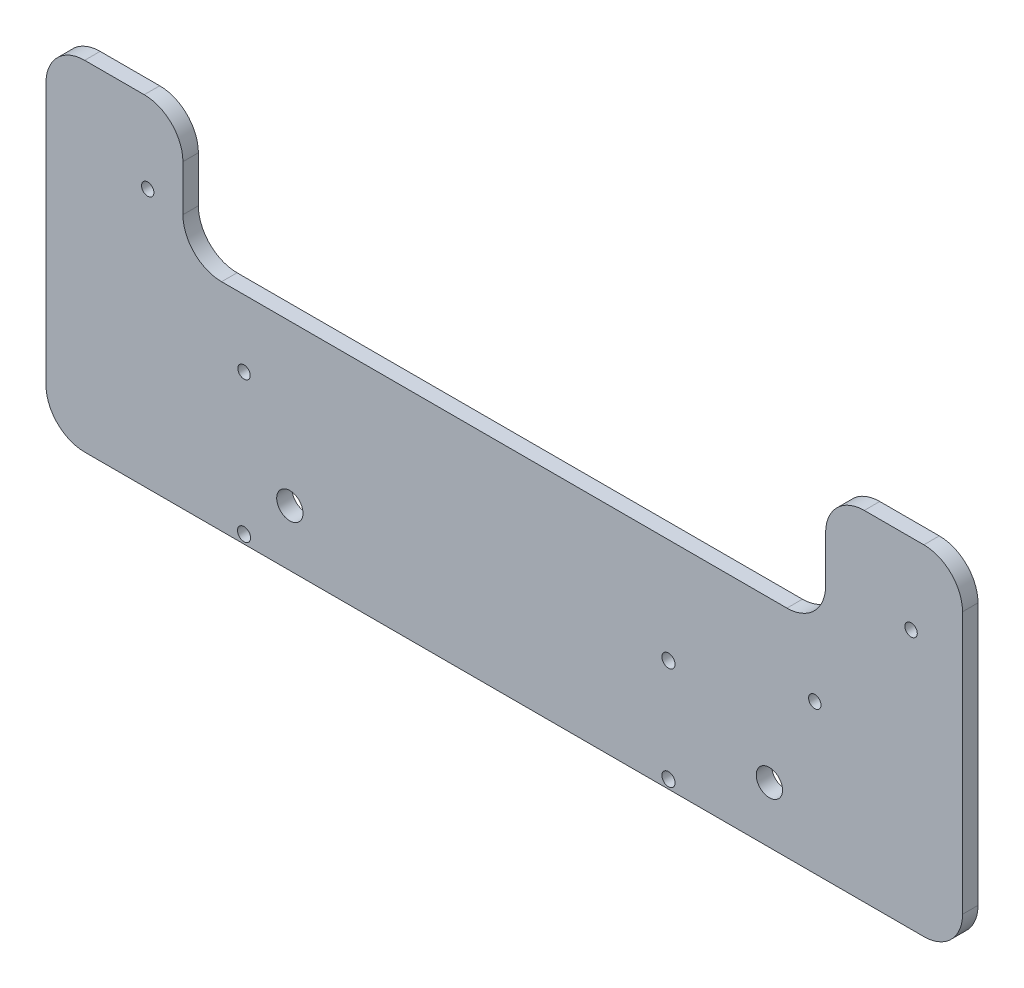
ISO-10303-21;
HEADER;
FILE_DESCRIPTION(('STEP AP214'),'2;1');
FILE_NAME('part.step','',(''),(''),'','','');
FILE_SCHEMA(('AUTOMOTIVE_DESIGN { 1 0 10303 214 1 1 1 1 }'));
ENDSEC;
DATA;
#1=APPLICATION_CONTEXT('core data for automotive mechanical design processes');
#2=APPLICATION_PROTOCOL_DEFINITION('international standard','automotive_design',2000,#1);
#3=PRODUCT_CONTEXT('',#1,'mechanical');
#4=PRODUCT('Part','Part','',(#3));
#5=PRODUCT_RELATED_PRODUCT_CATEGORY('part','',(#4));
#6=PRODUCT_DEFINITION_FORMATION('','',#4);
#7=PRODUCT_DEFINITION_CONTEXT('part definition',#1,'design');
#8=PRODUCT_DEFINITION('design','',#6,#7);
#9=PRODUCT_DEFINITION_SHAPE('','',#8);
#10=(LENGTH_UNIT() NAMED_UNIT(*) SI_UNIT(.MILLI.,.METRE.));
#11=(NAMED_UNIT(*) PLANE_ANGLE_UNIT() SI_UNIT($,.RADIAN.));
#12=(NAMED_UNIT(*) SI_UNIT($,.STERADIAN.) SOLID_ANGLE_UNIT());
#13=UNCERTAINTY_MEASURE_WITH_UNIT(LENGTH_MEASURE(1.E-05),#10,'distance_accuracy_value','');
#14=(GEOMETRIC_REPRESENTATION_CONTEXT(3) GLOBAL_UNCERTAINTY_ASSIGNED_CONTEXT((#13)) GLOBAL_UNIT_ASSIGNED_CONTEXT((#10,
#11,#12)) REPRESENTATION_CONTEXT('',''));
#15=CARTESIAN_POINT('',(0.,0.,0.));
#16=DIRECTION('',(0.,0.,1.));
#17=DIRECTION('',(1.,0.,0.));
#18=AXIS2_PLACEMENT_3D('',#15,#16,#17);
#19=CARTESIAN_POINT('',(128.627293892868,-271.718782294227,4.));
#20=DIRECTION('',(0.,-1.,0.));
#21=DIRECTION('',(0.,0.,-1.));
#22=AXIS2_PLACEMENT_3D('',#19,#20,#21);
#23=PLANE('',#22);
#24=DIRECTION('',(-1.,0.,0.));
#25=VECTOR('',#24,1.);
#26=CARTESIAN_POINT('',(128.627293892868,-271.718782294227,4.));
#27=LINE('',#26,#25);
#28=CARTESIAN_POINT('',(118.627293892868,-271.718782294227,4.));
#29=VERTEX_POINT('',#28);
#30=CARTESIAN_POINT('',(103.222758288593,-271.718782294227,4.));
#31=VERTEX_POINT('',#30);
#32=EDGE_CURVE('E384',#29,#31,#27,.T.);
#33=ORIENTED_EDGE('',*,*,#32,.F.);
#34=DIRECTION('',(0.,0.,-1.));
#35=VECTOR('',#34,1.);
#36=CARTESIAN_POINT('',(118.627293892868,-271.718782294227,4.));
#37=LINE('',#36,#35);
#38=CARTESIAN_POINT('',(118.627293892868,-271.718782294227,0.));
#39=VERTEX_POINT('',#38);
#40=EDGE_CURVE('E214',#29,#39,#37,.T.);
#41=ORIENTED_EDGE('',*,*,#40,.T.);
#42=DIRECTION('',(-1.,0.,0.));
#43=VECTOR('',#42,1.);
#44=CARTESIAN_POINT('',(128.627293892868,-271.718782294227,0.));
#45=LINE('',#44,#43);
#46=CARTESIAN_POINT('',(103.222758288593,-271.718782294227,0.));
#47=VERTEX_POINT('',#46);
#48=EDGE_CURVE('E275',#39,#47,#45,.T.);
#49=ORIENTED_EDGE('',*,*,#48,.T.);
#50=DIRECTION('',(0.,0.,-1.));
#51=VECTOR('',#50,1.);
#52=CARTESIAN_POINT('',(103.222758288593,-271.718782294227,4.));
#53=LINE('',#52,#51);
#54=EDGE_CURVE('E212',#47,#31,#53,.F.);
#55=ORIENTED_EDGE('',*,*,#54,.T.);
#56=EDGE_LOOP('',(#33,#41,#49,#55));
#57=FACE_BOUND('',#56,.T.);
#58=ADVANCED_FACE('F34',(#57),#23,.F.);
#59=CARTESIAN_POINT('',(93.2227582885929,-271.718782294227,4.));
#60=DIRECTION('',(1.,0.,0.));
#61=DIRECTION('',(0.,1.,0.));
#62=AXIS2_PLACEMENT_3D('',#59,#60,#61);
#63=PLANE('',#62);
#64=DIRECTION('',(0.,-1.,0.));
#65=VECTOR('',#64,1.);
#66=CARTESIAN_POINT('',(93.2227582885929,-271.718782294227,4.));
#67=LINE('',#66,#65);
#68=CARTESIAN_POINT('',(93.2227582885929,-281.718782294227,4.));
#69=VERTEX_POINT('',#68);
#70=CARTESIAN_POINT('',(93.222758288593,-293.597286203599,4.));
#71=VERTEX_POINT('',#70);
#72=EDGE_CURVE('E269',#69,#71,#67,.T.);
#73=ORIENTED_EDGE('',*,*,#72,.F.);
#74=DIRECTION('',(0.,0.,-1.));
#75=VECTOR('',#74,1.);
#76=CARTESIAN_POINT('',(93.2227582885929,-281.718782294227,4.));
#77=LINE('',#76,#75);
#78=CARTESIAN_POINT('',(93.2227582885929,-281.718782294227,0.));
#79=VERTEX_POINT('',#78);
#80=EDGE_CURVE('E219',#69,#79,#77,.T.);
#81=ORIENTED_EDGE('',*,*,#80,.T.);
#82=DIRECTION('',(0.,-1.,0.));
#83=VECTOR('',#82,1.);
#84=CARTESIAN_POINT('',(93.2227582885929,-271.718782294227,0.));
#85=LINE('',#84,#83);
#86=CARTESIAN_POINT('',(93.222758288593,-293.597286203599,0.));
#87=VERTEX_POINT('',#86);
#88=EDGE_CURVE('E253',#79,#87,#85,.T.);
#89=ORIENTED_EDGE('',*,*,#88,.T.);
#90=DIRECTION('',(0.,0.,-1.));
#91=VECTOR('',#90,1.);
#92=CARTESIAN_POINT('',(93.222758288593,-293.597286203599,4.));
#93=LINE('',#92,#91);
#94=EDGE_CURVE('E217',#87,#71,#93,.F.);
#95=ORIENTED_EDGE('',*,*,#94,.T.);
#96=EDGE_LOOP('',(#73,#81,#89,#95));
#97=FACE_BOUND('',#96,.T.);
#98=ADVANCED_FACE('F301',(#97),#63,.F.);
#99=CARTESIAN_POINT('',(93.222758288593,-303.597286203599,4.));
#100=DIRECTION('',(0.,-1.,0.));
#101=DIRECTION('',(0.,0.,-1.));
#102=AXIS2_PLACEMENT_3D('',#99,#100,#101);
#103=PLANE('',#102);
#104=DIRECTION('',(-1.,0.,0.));
#105=VECTOR('',#104,1.);
#106=CARTESIAN_POINT('',(93.222758288593,-303.597286203599,4.));
#107=LINE('',#106,#105);
#108=CARTESIAN_POINT('',(83.222758288593,-303.597286203599,4.));
#109=VERTEX_POINT('',#108);
#110=CARTESIAN_POINT('',(-62.9681705028575,-303.597286203599,4.));
#111=VERTEX_POINT('',#110);
#112=EDGE_CURVE('E261',#109,#111,#107,.T.);
#113=ORIENTED_EDGE('',*,*,#112,.F.);
#114=DIRECTION('',(0.,0.,-1.));
#115=VECTOR('',#114,1.);
#116=CARTESIAN_POINT('',(83.222758288593,-303.597286203599,0.));
#117=LINE('',#116,#115);
#118=CARTESIAN_POINT('',(83.222758288593,-303.597286203599,0.));
#119=VERTEX_POINT('',#118);
#120=EDGE_CURVE('E224',#109,#119,#117,.T.);
#121=ORIENTED_EDGE('',*,*,#120,.T.);
#122=DIRECTION('',(-1.,0.,0.));
#123=VECTOR('',#122,1.);
#124=CARTESIAN_POINT('',(93.222758288593,-303.597286203599,0.));
#125=LINE('',#124,#123);
#126=CARTESIAN_POINT('',(-62.9681705028575,-303.597286203599,0.));
#127=VERTEX_POINT('',#126);
#128=EDGE_CURVE('E242',#119,#127,#125,.T.);
#129=ORIENTED_EDGE('',*,*,#128,.T.);
#130=DIRECTION('',(0.,0.,-1.));
#131=VECTOR('',#130,1.);
#132=CARTESIAN_POINT('',(-62.9681705028574,-303.597286203599,4.));
#133=LINE('',#132,#131);
#134=EDGE_CURVE('E222',#127,#111,#133,.F.);
#135=ORIENTED_EDGE('',*,*,#134,.T.);
#136=EDGE_LOOP('',(#113,#121,#129,#135));
#137=FACE_BOUND('',#136,.T.);
#138=ADVANCED_FACE('F250',(#137),#103,.F.);
#139=CARTESIAN_POINT('',(-72.9681705028574,-271.718782294227,4.));
#140=DIRECTION('',(-1.,0.,0.));
#141=DIRECTION('',(0.,-1.,0.));
#142=AXIS2_PLACEMENT_3D('',#139,#140,#141);
#143=PLANE('',#142);
#144=DIRECTION('',(0.,1.,0.));
#145=VECTOR('',#144,1.);
#146=CARTESIAN_POINT('',(-72.9681705028574,-271.718782294227,4.));
#147=LINE('',#146,#145);
#148=CARTESIAN_POINT('',(-72.9681705028574,-293.597286203599,4.));
#149=VERTEX_POINT('',#148);
#150=CARTESIAN_POINT('',(-72.9681705028574,-281.718782294227,4.));
#151=VERTEX_POINT('',#150);
#152=EDGE_CURVE('E260',#149,#151,#147,.T.);
#153=ORIENTED_EDGE('',*,*,#152,.F.);
#154=DIRECTION('',(0.,0.,-1.));
#155=VECTOR('',#154,1.);
#156=CARTESIAN_POINT('',(-72.9681705028574,-293.597286203599,0.));
#157=LINE('',#156,#155);
#158=CARTESIAN_POINT('',(-72.9681705028574,-293.597286203599,0.));
#159=VERTEX_POINT('',#158);
#160=EDGE_CURVE('E233',#149,#159,#157,.T.);
#161=ORIENTED_EDGE('',*,*,#160,.T.);
#162=DIRECTION('',(0.,1.,0.));
#163=VECTOR('',#162,1.);
#164=CARTESIAN_POINT('',(-72.9681705028574,-271.718782294227,0.));
#165=LINE('',#164,#163);
#166=CARTESIAN_POINT('',(-72.9681705028574,-281.718782294227,0.));
#167=VERTEX_POINT('',#166);
#168=EDGE_CURVE('E244',#159,#167,#165,.T.);
#169=ORIENTED_EDGE('',*,*,#168,.T.);
#170=DIRECTION('',(0.,0.,-1.));
#171=VECTOR('',#170,1.);
#172=CARTESIAN_POINT('',(-72.9681705028574,-281.718782294227,4.));
#173=LINE('',#172,#171);
#174=EDGE_CURVE('E231',#167,#151,#173,.F.);
#175=ORIENTED_EDGE('',*,*,#174,.T.);
#176=EDGE_LOOP('',(#153,#161,#169,#175));
#177=FACE_BOUND('',#176,.T.);
#178=ADVANCED_FACE('F263',(#177),#143,.F.);
#179=CARTESIAN_POINT('',(-108.372706107132,-271.718782294227,4.));
#180=DIRECTION('',(0.,-1.,0.));
#181=DIRECTION('',(0.,0.,-1.));
#182=AXIS2_PLACEMENT_3D('',#179,#180,#181);
#183=PLANE('',#182);
#184=DIRECTION('',(-1.,0.,0.));
#185=VECTOR('',#184,1.);
#186=CARTESIAN_POINT('',(-108.372706107132,-271.718782294227,0.));
#187=LINE('',#186,#185);
#188=CARTESIAN_POINT('',(-82.9681705028574,-271.718782294227,0.));
#189=VERTEX_POINT('',#188);
#190=CARTESIAN_POINT('',(-98.3727061071322,-271.718782294227,0.));
#191=VERTEX_POINT('',#190);
#192=EDGE_CURVE('E180',#189,#191,#187,.T.);
#193=ORIENTED_EDGE('',*,*,#192,.T.);
#194=DIRECTION('',(0.,0.,-1.));
#195=VECTOR('',#194,1.);
#196=CARTESIAN_POINT('',(-98.3727061071322,-271.718782294227,4.));
#197=LINE('',#196,#195);
#198=CARTESIAN_POINT('',(-98.3727061071322,-271.718782294227,4.));
#199=VERTEX_POINT('',#198);
#200=EDGE_CURVE('E49',#191,#199,#197,.F.);
#201=ORIENTED_EDGE('',*,*,#200,.T.);
#202=DIRECTION('',(-1.,0.,0.));
#203=VECTOR('',#202,1.);
#204=CARTESIAN_POINT('',(-108.372706107132,-271.718782294227,4.));
#205=LINE('',#204,#203);
#206=CARTESIAN_POINT('',(-82.9681705028574,-271.718782294227,4.));
#207=VERTEX_POINT('',#206);
#208=EDGE_CURVE('E265',#207,#199,#205,.T.);
#209=ORIENTED_EDGE('',*,*,#208,.F.);
#210=DIRECTION('',(0.,0.,-1.));
#211=VECTOR('',#210,1.);
#212=CARTESIAN_POINT('',(-82.9681705028574,-271.718782294227,4.));
#213=LINE('',#212,#211);
#214=EDGE_CURVE('E227',#207,#189,#213,.T.);
#215=ORIENTED_EDGE('',*,*,#214,.T.);
#216=EDGE_LOOP('',(#193,#201,#209,#215));
#217=FACE_BOUND('',#216,.T.);
#218=ADVANCED_FACE('F282',(#217),#183,.F.);
#219=CARTESIAN_POINT('',(-108.372706107132,-305.665681156461,4.));
#220=DIRECTION('',(1.,0.,0.));
#221=DIRECTION('',(0.,0.,-1.));
#222=AXIS2_PLACEMENT_3D('',#219,#220,#221);
#223=PLANE('',#222);
#224=DIRECTION('',(0.,-1.,0.));
#225=VECTOR('',#224,1.);
#226=CARTESIAN_POINT('',(-108.372706107132,-305.665681156461,0.));
#227=LINE('',#226,#225);
#228=CARTESIAN_POINT('',(-108.372706107132,-281.718782294227,0.));
#229=VERTEX_POINT('',#228);
#230=CARTESIAN_POINT('',(-108.372706107132,-349.464720764101,0.));
#231=VERTEX_POINT('',#230);
#232=EDGE_CURVE('E175',#229,#231,#227,.T.);
#233=ORIENTED_EDGE('',*,*,#232,.T.);
#234=DIRECTION('',(0.,0.,-1.));
#235=VECTOR('',#234,1.);
#236=CARTESIAN_POINT('',(-108.372706107132,-349.464720764101,4.));
#237=LINE('',#236,#235);
#238=CARTESIAN_POINT('',(-108.372706107132,-349.464720764101,4.));
#239=VERTEX_POINT('',#238);
#240=EDGE_CURVE('E153',#231,#239,#237,.F.);
#241=ORIENTED_EDGE('',*,*,#240,.T.);
#242=DIRECTION('',(0.,-1.,0.));
#243=VECTOR('',#242,1.);
#244=CARTESIAN_POINT('',(-108.372706107132,-305.665681156461,4.));
#245=LINE('',#244,#243);
#246=CARTESIAN_POINT('',(-108.372706107132,-281.718782294227,4.));
#247=VERTEX_POINT('',#246);
#248=EDGE_CURVE('E267',#247,#239,#245,.T.);
#249=ORIENTED_EDGE('',*,*,#248,.F.);
#250=DIRECTION('',(0.,0.,-1.));
#251=VECTOR('',#250,1.);
#252=CARTESIAN_POINT('',(-108.372706107132,-281.718782294227,4.));
#253=LINE('',#252,#251);
#254=EDGE_CURVE('E158',#247,#229,#253,.T.);
#255=ORIENTED_EDGE('',*,*,#254,.T.);
#256=EDGE_LOOP('',(#233,#241,#249,#255));
#257=FACE_BOUND('',#256,.T.);
#258=ADVANCED_FACE('F290',(#257),#223,.F.);
#259=CARTESIAN_POINT('',(128.627293892868,-359.464720764101,4.));
#260=DIRECTION('',(0.,1.,0.));
#261=DIRECTION('',(0.,0.,1.));
#262=AXIS2_PLACEMENT_3D('',#259,#260,#261);
#263=PLANE('',#262);
#264=DIRECTION('',(1.,0.,0.));
#265=VECTOR('',#264,1.);
#266=CARTESIAN_POINT('',(128.627293892868,-359.464720764101,4.));
#267=LINE('',#266,#265);
#268=CARTESIAN_POINT('',(-98.3727061071322,-359.464720764101,4.));
#269=VERTEX_POINT('',#268);
#270=CARTESIAN_POINT('',(118.627293892868,-359.464720764101,4.));
#271=VERTEX_POINT('',#270);
#272=EDGE_CURVE('E168',#269,#271,#267,.T.);
#273=ORIENTED_EDGE('',*,*,#272,.F.);
#274=DIRECTION('',(0.,0.,-1.));
#275=VECTOR('',#274,1.);
#276=CARTESIAN_POINT('',(-98.3727061071322,-359.464720764101,4.));
#277=LINE('',#276,#275);
#278=CARTESIAN_POINT('',(-98.3727061071322,-359.464720764101,0.));
#279=VERTEX_POINT('',#278);
#280=EDGE_CURVE('E152',#269,#279,#277,.T.);
#281=ORIENTED_EDGE('',*,*,#280,.T.);
#282=DIRECTION('',(1.,0.,0.));
#283=VECTOR('',#282,1.);
#284=CARTESIAN_POINT('',(128.627293892868,-359.464720764101,0.));
#285=LINE('',#284,#283);
#286=CARTESIAN_POINT('',(118.627293892868,-359.464720764101,0.));
#287=VERTEX_POINT('',#286);
#288=EDGE_CURVE('E165',#279,#287,#285,.T.);
#289=ORIENTED_EDGE('',*,*,#288,.T.);
#290=DIRECTION('',(0.,0.,-1.));
#291=VECTOR('',#290,1.);
#292=CARTESIAN_POINT('',(118.627293892868,-359.464720764101,4.));
#293=LINE('',#292,#291);
#294=EDGE_CURVE('E170',#287,#271,#293,.F.);
#295=ORIENTED_EDGE('',*,*,#294,.T.);
#296=EDGE_LOOP('',(#273,#281,#289,#295));
#297=FACE_BOUND('',#296,.T.);
#298=ADVANCED_FACE('F164',(#297),#263,.F.);
#299=CARTESIAN_POINT('',(128.627293892868,-305.665681156461,4.));
#300=DIRECTION('',(-1.,0.,0.));
#301=DIRECTION('',(0.,0.,1.));
#302=AXIS2_PLACEMENT_3D('',#299,#300,#301);
#303=PLANE('',#302);
#304=DIRECTION('',(0.,1.,0.));
#305=VECTOR('',#304,1.);
#306=CARTESIAN_POINT('',(128.627293892868,-305.665681156461,4.));
#307=LINE('',#306,#305);
#308=CARTESIAN_POINT('',(128.627293892868,-349.464720764101,4.));
#309=VERTEX_POINT('',#308);
#310=CARTESIAN_POINT('',(128.627293892868,-281.718782294227,4.));
#311=VERTEX_POINT('',#310);
#312=EDGE_CURVE('E178',#309,#311,#307,.T.);
#313=ORIENTED_EDGE('',*,*,#312,.F.);
#314=DIRECTION('',(0.,0.,-1.));
#315=VECTOR('',#314,1.);
#316=CARTESIAN_POINT('',(128.627293892868,-349.464720764101,4.));
#317=LINE('',#316,#315);
#318=CARTESIAN_POINT('',(128.627293892868,-349.464720764101,0.));
#319=VERTEX_POINT('',#318);
#320=EDGE_CURVE('E209',#309,#319,#317,.T.);
#321=ORIENTED_EDGE('',*,*,#320,.T.);
#322=DIRECTION('',(0.,1.,0.));
#323=VECTOR('',#322,1.);
#324=CARTESIAN_POINT('',(128.627293892868,-305.665681156461,0.));
#325=LINE('',#324,#323);
#326=CARTESIAN_POINT('',(128.627293892868,-281.718782294227,0.));
#327=VERTEX_POINT('',#326);
#328=EDGE_CURVE('E174',#319,#327,#325,.T.);
#329=ORIENTED_EDGE('',*,*,#328,.T.);
#330=DIRECTION('',(0.,0.,-1.));
#331=VECTOR('',#330,1.);
#332=CARTESIAN_POINT('',(128.627293892868,-281.718782294227,4.));
#333=LINE('',#332,#331);
#334=EDGE_CURVE('E207',#327,#311,#333,.F.);
#335=ORIENTED_EDGE('',*,*,#334,.T.);
#336=EDGE_LOOP('',(#313,#321,#329,#335));
#337=FACE_BOUND('',#336,.T.);
#338=ADVANCED_FACE('F297',(#337),#303,.F.);
#339=CARTESIAN_POINT('',(0.,0.,4.));
#340=DIRECTION('',(0.,0.,1.));
#341=DIRECTION('',(1.,0.,0.));
#342=AXIS2_PLACEMENT_3D('',#339,#340,#341);
#343=PLANE('',#342);
#344=CARTESIAN_POINT('',(52.5925096813906,-330.665681156323,4.));
#345=DIRECTION('',(0.,0.,1.));
#346=DIRECTION('',(1.,0.,0.));
#347=AXIS2_PLACEMENT_3D('',#344,#345,#346);
#348=CIRCLE('',#347,1.69999999999999);
#349=CARTESIAN_POINT('',(54.2925096813906,-330.665681156323,4.));
#350=VERTEX_POINT('',#349);
#351=EDGE_CURVE('E450',#350,#350,#348,.T.);
#352=ORIENTED_EDGE('',*,*,#351,.F.);
#353=EDGE_LOOP('',(#352));
#354=FACE_BOUND('',#353,.T.);
#355=CARTESIAN_POINT('',(52.5925096813906,-357.226830960588,4.));
#356=DIRECTION('',(0.,0.,1.));
#357=DIRECTION('',(1.,0.,0.));
#358=AXIS2_PLACEMENT_3D('',#355,#356,#357);
#359=CIRCLE('',#358,1.69999999999999);
#360=CARTESIAN_POINT('',(54.2925096813906,-357.226830960588,4.));
#361=VERTEX_POINT('',#360);
#362=EDGE_CURVE('E444',#361,#361,#359,.T.);
#363=ORIENTED_EDGE('',*,*,#362,.F.);
#364=EDGE_LOOP('',(#363));
#365=FACE_BOUND('',#364,.T.);
#366=CARTESIAN_POINT('',(-57.1627061071324,-357.226830960588,4.));
#367=DIRECTION('',(0.,0.,1.));
#368=DIRECTION('',(1.,0.,0.));
#369=AXIS2_PLACEMENT_3D('',#366,#367,#368);
#370=CIRCLE('',#369,1.69999999999999);
#371=CARTESIAN_POINT('',(-55.4627061071324,-357.226830960588,4.));
#372=VERTEX_POINT('',#371);
#373=EDGE_CURVE('E438',#372,#372,#370,.T.);
#374=ORIENTED_EDGE('',*,*,#373,.F.);
#375=EDGE_LOOP('',(#374));
#376=FACE_BOUND('',#375,.T.);
#377=CARTESIAN_POINT('',(78.6810147920235,-344.935502047031,4.));
#378=DIRECTION('',(0.,0.,1.));
#379=DIRECTION('',(1.,0.,0.));
#380=AXIS2_PLACEMENT_3D('',#377,#378,#379);
#381=CIRCLE('',#380,3.4);
#382=CARTESIAN_POINT('',(82.0810147920235,-344.935502047031,4.));
#383=VERTEX_POINT('',#382);
#384=EDGE_CURVE('E432',#383,#383,#381,.T.);
#385=ORIENTED_EDGE('',*,*,#384,.F.);
#386=EDGE_LOOP('',(#385));
#387=FACE_BOUND('',#386,.T.);
#388=CARTESIAN_POINT('',(-45.3189852079763,-344.93550204679,4.));
#389=DIRECTION('',(0.,0.,1.));
#390=DIRECTION('',(1.,0.,0.));
#391=AXIS2_PLACEMENT_3D('',#388,#389,#390);
#392=CIRCLE('',#391,3.4);
#393=CARTESIAN_POINT('',(-41.9189852079763,-344.93550204679,4.));
#394=VERTEX_POINT('',#393);
#395=EDGE_CURVE('E426',#394,#394,#392,.T.);
#396=ORIENTED_EDGE('',*,*,#395,.F.);
#397=EDGE_LOOP('',(#396));
#398=FACE_BOUND('',#397,.T.);
#399=CARTESIAN_POINT('',(-82.0727061071323,-292.415681156461,4.));
#400=DIRECTION('',(0.,0.,1.));
#401=DIRECTION('',(1.,0.,0.));
#402=AXIS2_PLACEMENT_3D('',#399,#400,#401);
#403=CIRCLE('',#402,1.6);
#404=CARTESIAN_POINT('',(-80.4727061071324,-292.415681156461,4.));
#405=VERTEX_POINT('',#404);
#406=EDGE_CURVE('E420',#405,#405,#403,.T.);
#407=ORIENTED_EDGE('',*,*,#406,.F.);
#408=EDGE_LOOP('',(#407));
#409=FACE_BOUND('',#408,.T.);
#410=CARTESIAN_POINT('',(115.327293892868,-292.415681156461,4.));
#411=DIRECTION('',(0.,0.,1.));
#412=DIRECTION('',(1.,0.,0.));
#413=AXIS2_PLACEMENT_3D('',#410,#411,#412);
#414=CIRCLE('',#413,1.6);
#415=CARTESIAN_POINT('',(116.927293892868,-292.415681156461,4.));
#416=VERTEX_POINT('',#415);
#417=EDGE_CURVE('E414',#416,#416,#414,.T.);
#418=ORIENTED_EDGE('',*,*,#417,.F.);
#419=EDGE_LOOP('',(#418));
#420=FACE_BOUND('',#419,.T.);
#421=CARTESIAN_POINT('',(90.4172938928678,-320.91568115646,4.));
#422=DIRECTION('',(0.,0.,1.));
#423=DIRECTION('',(1.,0.,0.));
#424=AXIS2_PLACEMENT_3D('',#421,#422,#423);
#425=CIRCLE('',#424,1.6);
#426=CARTESIAN_POINT('',(92.0172938928678,-320.91568115646,4.));
#427=VERTEX_POINT('',#426);
#428=EDGE_CURVE('E408',#427,#427,#425,.T.);
#429=ORIENTED_EDGE('',*,*,#428,.F.);
#430=EDGE_LOOP('',(#429));
#431=FACE_BOUND('',#430,.T.);
#432=CARTESIAN_POINT('',(-57.1627061071323,-320.91568115646,4.));
#433=DIRECTION('',(0.,0.,1.));
#434=DIRECTION('',(1.,0.,0.));
#435=AXIS2_PLACEMENT_3D('',#432,#433,#434);
#436=CIRCLE('',#435,1.6);
#437=CARTESIAN_POINT('',(-55.5627061071323,-320.91568115646,4.));
#438=VERTEX_POINT('',#437);
#439=EDGE_CURVE('E402',#438,#438,#436,.T.);
#440=ORIENTED_EDGE('',*,*,#439,.F.);
#441=EDGE_LOOP('',(#440));
#442=FACE_BOUND('',#441,.T.);
#443=ORIENTED_EDGE('',*,*,#248,.T.);
#444=CARTESIAN_POINT('',(-98.3727061071322,-349.464720764101,4.));
#445=DIRECTION('',(0.,0.,1.));
#446=DIRECTION('',(1.,0.,0.));
#447=AXIS2_PLACEMENT_3D('',#444,#445,#446);
#448=CIRCLE('',#447,10.);
#449=EDGE_CURVE('E205',#239,#269,#448,.T.);
#450=ORIENTED_EDGE('',*,*,#449,.T.);
#451=ORIENTED_EDGE('',*,*,#272,.T.);
#452=CARTESIAN_POINT('',(118.627293892868,-349.464720764101,4.));
#453=DIRECTION('',(0.,0.,1.));
#454=DIRECTION('',(1.,0.,0.));
#455=AXIS2_PLACEMENT_3D('',#452,#453,#454);
#456=CIRCLE('',#455,10.);
#457=EDGE_CURVE('E203',#271,#309,#456,.T.);
#458=ORIENTED_EDGE('',*,*,#457,.T.);
#459=ORIENTED_EDGE('',*,*,#312,.T.);
#460=CARTESIAN_POINT('',(118.627293892868,-281.718782294227,4.));
#461=DIRECTION('',(0.,0.,1.));
#462=DIRECTION('',(1.,0.,0.));
#463=AXIS2_PLACEMENT_3D('',#460,#461,#462);
#464=CIRCLE('',#463,10.);
#465=EDGE_CURVE('E201',#311,#29,#464,.T.);
#466=ORIENTED_EDGE('',*,*,#465,.T.);
#467=ORIENTED_EDGE('',*,*,#32,.T.);
#468=CARTESIAN_POINT('',(103.222758288593,-281.718782294227,4.));
#469=DIRECTION('',(0.,0.,1.));
#470=DIRECTION('',(1.,0.,0.));
#471=AXIS2_PLACEMENT_3D('',#468,#469,#470);
#472=CIRCLE('',#471,10.);
#473=EDGE_CURVE('E199',#31,#69,#472,.T.);
#474=ORIENTED_EDGE('',*,*,#473,.T.);
#475=ORIENTED_EDGE('',*,*,#72,.T.);
#476=CARTESIAN_POINT('',(83.222758288593,-293.597286203599,4.));
#477=DIRECTION('',(0.,0.,1.));
#478=DIRECTION('',(1.,0.,0.));
#479=AXIS2_PLACEMENT_3D('',#476,#477,#478);
#480=CIRCLE('',#479,10.);
#481=EDGE_CURVE('E238',#71,#109,#480,.F.);
#482=ORIENTED_EDGE('',*,*,#481,.T.);
#483=ORIENTED_EDGE('',*,*,#112,.T.);
#484=CARTESIAN_POINT('',(-62.9681705028574,-293.597286203599,4.));
#485=DIRECTION('',(0.,0.,1.));
#486=DIRECTION('',(1.,0.,0.));
#487=AXIS2_PLACEMENT_3D('',#484,#485,#486);
#488=CIRCLE('',#487,10.);
#489=EDGE_CURVE('E11',#111,#149,#488,.F.);
#490=ORIENTED_EDGE('',*,*,#489,.T.);
#491=ORIENTED_EDGE('',*,*,#152,.T.);
#492=CARTESIAN_POINT('',(-82.9681705028574,-281.718782294227,4.));
#493=DIRECTION('',(0.,0.,1.));
#494=DIRECTION('',(1.,0.,0.));
#495=AXIS2_PLACEMENT_3D('',#492,#493,#494);
#496=CIRCLE('',#495,10.);
#497=EDGE_CURVE('E56',#151,#207,#496,.T.);
#498=ORIENTED_EDGE('',*,*,#497,.T.);
#499=ORIENTED_EDGE('',*,*,#208,.T.);
#500=CARTESIAN_POINT('',(-98.3727061071322,-281.718782294227,4.));
#501=DIRECTION('',(0.,0.,1.));
#502=DIRECTION('',(1.,0.,0.));
#503=AXIS2_PLACEMENT_3D('',#500,#501,#502);
#504=CIRCLE('',#503,10.);
#505=EDGE_CURVE('E197',#199,#247,#504,.T.);
#506=ORIENTED_EDGE('',*,*,#505,.T.);
#507=EDGE_LOOP('',(#443,#450,#451,#458,#459,#466,#467,#474,#475,#482,#483,#490,#491,#498,#499,#506));
#508=FACE_BOUND('',#507,.T.);
#509=ADVANCED_FACE('F259',(#354,#365,#376,#387,#398,#409,#420,#431,#442,#508),#343,.T.);
#510=CARTESIAN_POINT('',(0.,0.,0.));
#511=DIRECTION('',(0.,0.,1.));
#512=DIRECTION('',(1.,0.,0.));
#513=AXIS2_PLACEMENT_3D('',#510,#511,#512);
#514=PLANE('',#513);
#515=CARTESIAN_POINT('',(52.5925096813906,-330.665681156323,0.));
#516=DIRECTION('',(0.,0.,1.));
#517=DIRECTION('',(1.,0.,0.));
#518=AXIS2_PLACEMENT_3D('',#515,#516,#517);
#519=CIRCLE('',#518,1.7);
#520=CARTESIAN_POINT('',(54.2925096813906,-330.665681156323,0.));
#521=VERTEX_POINT('',#520);
#522=EDGE_CURVE('E447',#521,#521,#519,.T.);
#523=ORIENTED_EDGE('',*,*,#522,.T.);
#524=EDGE_LOOP('',(#523));
#525=FACE_BOUND('',#524,.T.);
#526=CARTESIAN_POINT('',(52.5925096813906,-357.226830960588,0.));
#527=DIRECTION('',(0.,0.,1.));
#528=DIRECTION('',(1.,0.,0.));
#529=AXIS2_PLACEMENT_3D('',#526,#527,#528);
#530=CIRCLE('',#529,1.7);
#531=CARTESIAN_POINT('',(54.2925096813906,-357.226830960588,0.));
#532=VERTEX_POINT('',#531);
#533=EDGE_CURVE('E441',#532,#532,#530,.T.);
#534=ORIENTED_EDGE('',*,*,#533,.T.);
#535=EDGE_LOOP('',(#534));
#536=FACE_BOUND('',#535,.T.);
#537=CARTESIAN_POINT('',(-57.1627061071324,-357.226830960588,0.));
#538=DIRECTION('',(0.,0.,1.));
#539=DIRECTION('',(1.,0.,0.));
#540=AXIS2_PLACEMENT_3D('',#537,#538,#539);
#541=CIRCLE('',#540,1.7);
#542=CARTESIAN_POINT('',(-55.4627061071324,-357.226830960588,0.));
#543=VERTEX_POINT('',#542);
#544=EDGE_CURVE('E435',#543,#543,#541,.T.);
#545=ORIENTED_EDGE('',*,*,#544,.T.);
#546=EDGE_LOOP('',(#545));
#547=FACE_BOUND('',#546,.T.);
#548=CARTESIAN_POINT('',(78.6810147920235,-344.935502047031,0.));
#549=DIRECTION('',(0.,0.,1.));
#550=DIRECTION('',(1.,0.,0.));
#551=AXIS2_PLACEMENT_3D('',#548,#549,#550);
#552=CIRCLE('',#551,3.4);
#553=CARTESIAN_POINT('',(82.0810147920235,-344.935502047031,0.));
#554=VERTEX_POINT('',#553);
#555=EDGE_CURVE('E429',#554,#554,#552,.T.);
#556=ORIENTED_EDGE('',*,*,#555,.T.);
#557=EDGE_LOOP('',(#556));
#558=FACE_BOUND('',#557,.T.);
#559=CARTESIAN_POINT('',(-45.3189852079763,-344.93550204679,0.));
#560=DIRECTION('',(0.,0.,1.));
#561=DIRECTION('',(1.,0.,0.));
#562=AXIS2_PLACEMENT_3D('',#559,#560,#561);
#563=CIRCLE('',#562,3.4);
#564=CARTESIAN_POINT('',(-41.9189852079763,-344.93550204679,0.));
#565=VERTEX_POINT('',#564);
#566=EDGE_CURVE('E423',#565,#565,#563,.T.);
#567=ORIENTED_EDGE('',*,*,#566,.T.);
#568=EDGE_LOOP('',(#567));
#569=FACE_BOUND('',#568,.T.);
#570=CARTESIAN_POINT('',(-82.0727061071323,-292.415681156461,0.));
#571=DIRECTION('',(0.,0.,1.));
#572=DIRECTION('',(1.,0.,0.));
#573=AXIS2_PLACEMENT_3D('',#570,#571,#572);
#574=CIRCLE('',#573,1.6);
#575=CARTESIAN_POINT('',(-80.4727061071324,-292.415681156461,0.));
#576=VERTEX_POINT('',#575);
#577=EDGE_CURVE('E417',#576,#576,#574,.T.);
#578=ORIENTED_EDGE('',*,*,#577,.T.);
#579=EDGE_LOOP('',(#578));
#580=FACE_BOUND('',#579,.T.);
#581=CARTESIAN_POINT('',(115.327293892868,-292.415681156461,0.));
#582=DIRECTION('',(0.,0.,1.));
#583=DIRECTION('',(1.,0.,0.));
#584=AXIS2_PLACEMENT_3D('',#581,#582,#583);
#585=CIRCLE('',#584,1.6);
#586=CARTESIAN_POINT('',(116.927293892868,-292.415681156461,0.));
#587=VERTEX_POINT('',#586);
#588=EDGE_CURVE('E411',#587,#587,#585,.T.);
#589=ORIENTED_EDGE('',*,*,#588,.T.);
#590=EDGE_LOOP('',(#589));
#591=FACE_BOUND('',#590,.T.);
#592=CARTESIAN_POINT('',(90.4172938928678,-320.91568115646,0.));
#593=DIRECTION('',(0.,0.,1.));
#594=DIRECTION('',(1.,0.,0.));
#595=AXIS2_PLACEMENT_3D('',#592,#593,#594);
#596=CIRCLE('',#595,1.6);
#597=CARTESIAN_POINT('',(92.0172938928678,-320.91568115646,0.));
#598=VERTEX_POINT('',#597);
#599=EDGE_CURVE('E405',#598,#598,#596,.T.);
#600=ORIENTED_EDGE('',*,*,#599,.T.);
#601=EDGE_LOOP('',(#600));
#602=FACE_BOUND('',#601,.T.);
#603=CARTESIAN_POINT('',(-57.1627061071323,-320.91568115646,0.));
#604=DIRECTION('',(0.,0.,1.));
#605=DIRECTION('',(1.,0.,0.));
#606=AXIS2_PLACEMENT_3D('',#603,#604,#605);
#607=CIRCLE('',#606,1.6);
#608=CARTESIAN_POINT('',(-55.5627061071323,-320.91568115646,0.));
#609=VERTEX_POINT('',#608);
#610=EDGE_CURVE('E278',#609,#609,#607,.T.);
#611=ORIENTED_EDGE('',*,*,#610,.T.);
#612=EDGE_LOOP('',(#611));
#613=FACE_BOUND('',#612,.T.);
#614=ORIENTED_EDGE('',*,*,#288,.F.);
#615=CARTESIAN_POINT('',(-98.3727061071322,-349.464720764101,0.));
#616=DIRECTION('',(0.,0.,1.));
#617=DIRECTION('',(1.,0.,0.));
#618=AXIS2_PLACEMENT_3D('',#615,#616,#617);
#619=CIRCLE('',#618,10.);
#620=EDGE_CURVE('E148',#279,#231,#619,.F.);
#621=ORIENTED_EDGE('',*,*,#620,.T.);
#622=ORIENTED_EDGE('',*,*,#232,.F.);
#623=CARTESIAN_POINT('',(-98.3727061071322,-281.718782294227,0.));
#624=DIRECTION('',(0.,0.,1.));
#625=DIRECTION('',(1.,0.,0.));
#626=AXIS2_PLACEMENT_3D('',#623,#624,#625);
#627=CIRCLE('',#626,10.);
#628=EDGE_CURVE('E186',#229,#191,#627,.F.);
#629=ORIENTED_EDGE('',*,*,#628,.T.);
#630=ORIENTED_EDGE('',*,*,#192,.F.);
#631=CARTESIAN_POINT('',(-82.9681705028574,-281.718782294227,0.));
#632=DIRECTION('',(0.,0.,1.));
#633=DIRECTION('',(1.,0.,0.));
#634=AXIS2_PLACEMENT_3D('',#631,#632,#633);
#635=CIRCLE('',#634,10.);
#636=EDGE_CURVE('E169',#189,#167,#635,.F.);
#637=ORIENTED_EDGE('',*,*,#636,.T.);
#638=ORIENTED_EDGE('',*,*,#168,.F.);
#639=CARTESIAN_POINT('',(-62.9681705028574,-293.597286203599,0.));
#640=DIRECTION('',(0.,0.,1.));
#641=DIRECTION('',(1.,0.,0.));
#642=AXIS2_PLACEMENT_3D('',#639,#640,#641);
#643=CIRCLE('',#642,10.);
#644=EDGE_CURVE('E42',#159,#127,#643,.T.);
#645=ORIENTED_EDGE('',*,*,#644,.T.);
#646=ORIENTED_EDGE('',*,*,#128,.F.);
#647=CARTESIAN_POINT('',(83.222758288593,-293.597286203599,0.));
#648=DIRECTION('',(0.,0.,1.));
#649=DIRECTION('',(1.,0.,0.));
#650=AXIS2_PLACEMENT_3D('',#647,#648,#649);
#651=CIRCLE('',#650,10.);
#652=EDGE_CURVE('E236',#119,#87,#651,.T.);
#653=ORIENTED_EDGE('',*,*,#652,.T.);
#654=ORIENTED_EDGE('',*,*,#88,.F.);
#655=CARTESIAN_POINT('',(103.222758288593,-281.718782294227,0.));
#656=DIRECTION('',(0.,0.,1.));
#657=DIRECTION('',(1.,0.,0.));
#658=AXIS2_PLACEMENT_3D('',#655,#656,#657);
#659=CIRCLE('',#658,10.);
#660=EDGE_CURVE('E188',#79,#47,#659,.F.);
#661=ORIENTED_EDGE('',*,*,#660,.T.);
#662=ORIENTED_EDGE('',*,*,#48,.F.);
#663=CARTESIAN_POINT('',(118.627293892868,-281.718782294227,0.));
#664=DIRECTION('',(0.,0.,1.));
#665=DIRECTION('',(1.,0.,0.));
#666=AXIS2_PLACEMENT_3D('',#663,#664,#665);
#667=CIRCLE('',#666,10.);
#668=EDGE_CURVE('E190',#39,#327,#667,.F.);
#669=ORIENTED_EDGE('',*,*,#668,.T.);
#670=ORIENTED_EDGE('',*,*,#328,.F.);
#671=CARTESIAN_POINT('',(118.627293892868,-349.464720764101,0.));
#672=DIRECTION('',(0.,0.,1.));
#673=DIRECTION('',(1.,0.,0.));
#674=AXIS2_PLACEMENT_3D('',#671,#672,#673);
#675=CIRCLE('',#674,10.);
#676=EDGE_CURVE('E159',#319,#287,#675,.F.);
#677=ORIENTED_EDGE('',*,*,#676,.T.);
#678=EDGE_LOOP('',(#614,#621,#622,#629,#630,#637,#638,#645,#646,#653,#654,#661,#662,#669,#670,#677));
#679=FACE_BOUND('',#678,.T.);
#680=ADVANCED_FACE('F172',(#525,#536,#547,#558,#569,#580,#591,#602,#613,#679),#514,.F.);
#681=CARTESIAN_POINT('',(-57.1627061071323,-320.91568115646,4.));
#682=DIRECTION('',(0.,0.,1.));
#683=DIRECTION('',(1.,0.,0.));
#684=AXIS2_PLACEMENT_3D('',#681,#682,#683);
#685=CYLINDRICAL_SURFACE('',#684,1.6);
#686=ORIENTED_EDGE('',*,*,#610,.F.);
#687=EDGE_LOOP('',(#686));
#688=FACE_BOUND('',#687,.T.);
#689=ORIENTED_EDGE('',*,*,#439,.T.);
#690=EDGE_LOOP('',(#689));
#691=FACE_BOUND('',#690,.T.);
#692=ADVANCED_FACE('F364',(#688,#691),#685,.F.);
#693=CARTESIAN_POINT('',(90.4172938928678,-320.91568115646,4.));
#694=DIRECTION('',(0.,0.,1.));
#695=DIRECTION('',(1.,0.,0.));
#696=AXIS2_PLACEMENT_3D('',#693,#694,#695);
#697=CYLINDRICAL_SURFACE('',#696,1.6);
#698=ORIENTED_EDGE('',*,*,#599,.F.);
#699=EDGE_LOOP('',(#698));
#700=FACE_BOUND('',#699,.T.);
#701=ORIENTED_EDGE('',*,*,#428,.T.);
#702=EDGE_LOOP('',(#701));
#703=FACE_BOUND('',#702,.T.);
#704=ADVANCED_FACE('F360',(#700,#703),#697,.F.);
#705=CARTESIAN_POINT('',(115.327293892868,-292.415681156461,4.));
#706=DIRECTION('',(0.,0.,1.));
#707=DIRECTION('',(1.,0.,0.));
#708=AXIS2_PLACEMENT_3D('',#705,#706,#707);
#709=CYLINDRICAL_SURFACE('',#708,1.6);
#710=ORIENTED_EDGE('',*,*,#588,.F.);
#711=EDGE_LOOP('',(#710));
#712=FACE_BOUND('',#711,.T.);
#713=ORIENTED_EDGE('',*,*,#417,.T.);
#714=EDGE_LOOP('',(#713));
#715=FACE_BOUND('',#714,.T.);
#716=ADVANCED_FACE('F356',(#712,#715),#709,.F.);
#717=CARTESIAN_POINT('',(-82.0727061071323,-292.415681156461,4.));
#718=DIRECTION('',(0.,0.,1.));
#719=DIRECTION('',(1.,0.,0.));
#720=AXIS2_PLACEMENT_3D('',#717,#718,#719);
#721=CYLINDRICAL_SURFACE('',#720,1.6);
#722=ORIENTED_EDGE('',*,*,#577,.F.);
#723=EDGE_LOOP('',(#722));
#724=FACE_BOUND('',#723,.T.);
#725=ORIENTED_EDGE('',*,*,#406,.T.);
#726=EDGE_LOOP('',(#725));
#727=FACE_BOUND('',#726,.T.);
#728=ADVANCED_FACE('F315',(#724,#727),#721,.F.);
#729=CARTESIAN_POINT('',(-98.3727061071322,-349.464720764101,4.));
#730=DIRECTION('',(0.,0.,-1.));
#731=DIRECTION('',(-1.,0.,0.));
#732=AXIS2_PLACEMENT_3D('',#729,#730,#731);
#733=CYLINDRICAL_SURFACE('',#732,10.);
#734=ORIENTED_EDGE('',*,*,#449,.F.);
#735=ORIENTED_EDGE('',*,*,#240,.F.);
#736=ORIENTED_EDGE('',*,*,#620,.F.);
#737=ORIENTED_EDGE('',*,*,#280,.F.);
#738=EDGE_LOOP('',(#734,#735,#736,#737));
#739=FACE_BOUND('',#738,.T.);
#740=ADVANCED_FACE('F151',(#739),#733,.T.);
#741=CARTESIAN_POINT('',(118.627293892868,-349.464720764101,4.));
#742=DIRECTION('',(0.,0.,-1.));
#743=DIRECTION('',(-1.,0.,0.));
#744=AXIS2_PLACEMENT_3D('',#741,#742,#743);
#745=CYLINDRICAL_SURFACE('',#744,10.);
#746=ORIENTED_EDGE('',*,*,#457,.F.);
#747=ORIENTED_EDGE('',*,*,#294,.F.);
#748=ORIENTED_EDGE('',*,*,#676,.F.);
#749=ORIENTED_EDGE('',*,*,#320,.F.);
#750=EDGE_LOOP('',(#746,#747,#748,#749));
#751=FACE_BOUND('',#750,.T.);
#752=ADVANCED_FACE('F314',(#751),#745,.T.);
#753=CARTESIAN_POINT('',(118.627293892868,-281.718782294227,4.));
#754=DIRECTION('',(0.,0.,-1.));
#755=DIRECTION('',(-1.,0.,0.));
#756=AXIS2_PLACEMENT_3D('',#753,#754,#755);
#757=CYLINDRICAL_SURFACE('',#756,10.);
#758=ORIENTED_EDGE('',*,*,#465,.F.);
#759=ORIENTED_EDGE('',*,*,#334,.F.);
#760=ORIENTED_EDGE('',*,*,#668,.F.);
#761=ORIENTED_EDGE('',*,*,#40,.F.);
#762=EDGE_LOOP('',(#758,#759,#760,#761));
#763=FACE_BOUND('',#762,.T.);
#764=ADVANCED_FACE('F318',(#763),#757,.T.);
#765=CARTESIAN_POINT('',(103.222758288593,-281.718782294227,4.));
#766=DIRECTION('',(0.,0.,-1.));
#767=DIRECTION('',(-1.,0.,0.));
#768=AXIS2_PLACEMENT_3D('',#765,#766,#767);
#769=CYLINDRICAL_SURFACE('',#768,10.);
#770=ORIENTED_EDGE('',*,*,#473,.F.);
#771=ORIENTED_EDGE('',*,*,#54,.F.);
#772=ORIENTED_EDGE('',*,*,#660,.F.);
#773=ORIENTED_EDGE('',*,*,#80,.F.);
#774=EDGE_LOOP('',(#770,#771,#772,#773));
#775=FACE_BOUND('',#774,.T.);
#776=ADVANCED_FACE('F322',(#775),#769,.T.);
#777=CARTESIAN_POINT('',(83.222758288593,-293.597286203599,4.));
#778=DIRECTION('',(0.,0.,1.));
#779=DIRECTION('',(1.,0.,0.));
#780=AXIS2_PLACEMENT_3D('',#777,#778,#779);
#781=CYLINDRICAL_SURFACE('',#780,10.);
#782=ORIENTED_EDGE('',*,*,#481,.F.);
#783=ORIENTED_EDGE('',*,*,#94,.F.);
#784=ORIENTED_EDGE('',*,*,#652,.F.);
#785=ORIENTED_EDGE('',*,*,#120,.F.);
#786=EDGE_LOOP('',(#782,#783,#784,#785));
#787=FACE_BOUND('',#786,.T.);
#788=ADVANCED_FACE('F326',(#787),#781,.F.);
#789=CARTESIAN_POINT('',(-98.3727061071322,-281.718782294227,4.));
#790=DIRECTION('',(0.,0.,-1.));
#791=DIRECTION('',(-1.,0.,0.));
#792=AXIS2_PLACEMENT_3D('',#789,#790,#791);
#793=CYLINDRICAL_SURFACE('',#792,10.);
#794=ORIENTED_EDGE('',*,*,#505,.F.);
#795=ORIENTED_EDGE('',*,*,#200,.F.);
#796=ORIENTED_EDGE('',*,*,#628,.F.);
#797=ORIENTED_EDGE('',*,*,#254,.F.);
#798=EDGE_LOOP('',(#794,#795,#796,#797));
#799=FACE_BOUND('',#798,.T.);
#800=ADVANCED_FACE('F286',(#799),#793,.T.);
#801=CARTESIAN_POINT('',(-62.9681705028574,-293.597286203599,4.));
#802=DIRECTION('',(0.,0.,1.));
#803=DIRECTION('',(1.,0.,0.));
#804=AXIS2_PLACEMENT_3D('',#801,#802,#803);
#805=CYLINDRICAL_SURFACE('',#804,10.);
#806=ORIENTED_EDGE('',*,*,#489,.F.);
#807=ORIENTED_EDGE('',*,*,#134,.F.);
#808=ORIENTED_EDGE('',*,*,#644,.F.);
#809=ORIENTED_EDGE('',*,*,#160,.F.);
#810=EDGE_LOOP('',(#806,#807,#808,#809));
#811=FACE_BOUND('',#810,.T.);
#812=ADVANCED_FACE('F256',(#811),#805,.F.);
#813=CARTESIAN_POINT('',(-82.9681705028574,-281.718782294227,4.));
#814=DIRECTION('',(0.,0.,-1.));
#815=DIRECTION('',(-1.,0.,0.));
#816=AXIS2_PLACEMENT_3D('',#813,#814,#815);
#817=CYLINDRICAL_SURFACE('',#816,10.);
#818=ORIENTED_EDGE('',*,*,#497,.F.);
#819=ORIENTED_EDGE('',*,*,#174,.F.);
#820=ORIENTED_EDGE('',*,*,#636,.F.);
#821=ORIENTED_EDGE('',*,*,#214,.F.);
#822=EDGE_LOOP('',(#818,#819,#820,#821));
#823=FACE_BOUND('',#822,.T.);
#824=ADVANCED_FACE('F36',(#823),#817,.T.);
#825=CARTESIAN_POINT('',(-45.3189852079763,-344.93550204679,4.));
#826=DIRECTION('',(0.,0.,1.));
#827=DIRECTION('',(1.,0.,0.));
#828=AXIS2_PLACEMENT_3D('',#825,#826,#827);
#829=CYLINDRICAL_SURFACE('',#828,3.4);
#830=ORIENTED_EDGE('',*,*,#566,.F.);
#831=EDGE_LOOP('',(#830));
#832=FACE_BOUND('',#831,.T.);
#833=ORIENTED_EDGE('',*,*,#395,.T.);
#834=EDGE_LOOP('',(#833));
#835=FACE_BOUND('',#834,.T.);
#836=ADVANCED_FACE('F336',(#832,#835),#829,.F.);
#837=CARTESIAN_POINT('',(78.6810147920235,-344.935502047031,4.));
#838=DIRECTION('',(0.,0.,1.));
#839=DIRECTION('',(1.,0.,0.));
#840=AXIS2_PLACEMENT_3D('',#837,#838,#839);
#841=CYLINDRICAL_SURFACE('',#840,3.4);
#842=ORIENTED_EDGE('',*,*,#555,.F.);
#843=EDGE_LOOP('',(#842));
#844=FACE_BOUND('',#843,.T.);
#845=ORIENTED_EDGE('',*,*,#384,.T.);
#846=EDGE_LOOP('',(#845));
#847=FACE_BOUND('',#846,.T.);
#848=ADVANCED_FACE('F341',(#844,#847),#841,.F.);
#849=CARTESIAN_POINT('',(-57.1627061071324,-357.226830960588,4.));
#850=DIRECTION('',(0.,0.,1.));
#851=DIRECTION('',(1.,0.,0.));
#852=AXIS2_PLACEMENT_3D('',#849,#850,#851);
#853=CYLINDRICAL_SURFACE('',#852,1.69999999999999);
#854=ORIENTED_EDGE('',*,*,#544,.F.);
#855=EDGE_LOOP('',(#854));
#856=FACE_BOUND('',#855,.T.);
#857=ORIENTED_EDGE('',*,*,#373,.T.);
#858=EDGE_LOOP('',(#857));
#859=FACE_BOUND('',#858,.T.);
#860=ADVANCED_FACE('F347',(#856,#859),#853,.F.);
#861=CARTESIAN_POINT('',(52.5925096813906,-357.226830960588,4.));
#862=DIRECTION('',(0.,0.,1.));
#863=DIRECTION('',(1.,0.,0.));
#864=AXIS2_PLACEMENT_3D('',#861,#862,#863);
#865=CYLINDRICAL_SURFACE('',#864,1.69999999999999);
#866=ORIENTED_EDGE('',*,*,#533,.F.);
#867=EDGE_LOOP('',(#866));
#868=FACE_BOUND('',#867,.T.);
#869=ORIENTED_EDGE('',*,*,#362,.T.);
#870=EDGE_LOOP('',(#869));
#871=FACE_BOUND('',#870,.T.);
#872=ADVANCED_FACE('F478',(#868,#871),#865,.F.);
#873=CARTESIAN_POINT('',(52.5925096813906,-330.665681156323,4.));
#874=DIRECTION('',(0.,0.,1.));
#875=DIRECTION('',(1.,0.,0.));
#876=AXIS2_PLACEMENT_3D('',#873,#874,#875);
#877=CYLINDRICAL_SURFACE('',#876,1.69999999999999);
#878=ORIENTED_EDGE('',*,*,#522,.F.);
#879=EDGE_LOOP('',(#878));
#880=FACE_BOUND('',#879,.T.);
#881=ORIENTED_EDGE('',*,*,#351,.T.);
#882=EDGE_LOOP('',(#881));
#883=FACE_BOUND('',#882,.T.);
#884=ADVANCED_FACE('F454',(#880,#883),#877,.F.);
#885=CLOSED_SHELL('',(#58,#98,#138,#178,#218,#258,#298,#338,#509,#680,#692,#704,#716,#728,#740,
#752,#764,#776,#788,#800,#812,#824,#836,#848,#860,#872,#884));
#886=MANIFOLD_SOLID_BREP('B2',#885);
#887=ADVANCED_BREP_SHAPE_REPRESENTATION('',(#18,#886),#14);
#888=SHAPE_DEFINITION_REPRESENTATION(#9,#887);
ENDSEC;
END-ISO-10303-21;
